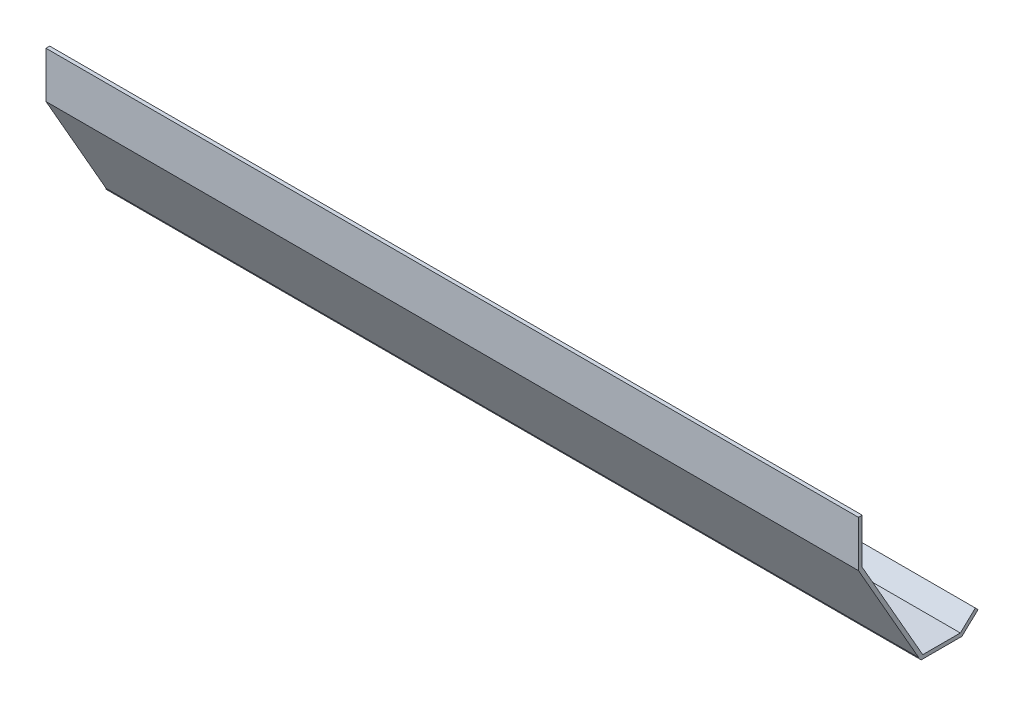
ISO-10303-21;
HEADER;
FILE_DESCRIPTION(('STEP AP214'),'2;1');
FILE_NAME('part.step','',(''),(''),'','','');
FILE_SCHEMA(('AUTOMOTIVE_DESIGN { 1 0 10303 214 1 1 1 1 }'));
ENDSEC;
DATA;
#1=APPLICATION_CONTEXT('core data for automotive mechanical design processes');
#2=APPLICATION_PROTOCOL_DEFINITION('international standard','automotive_design',2000,#1);
#3=PRODUCT_CONTEXT('',#1,'mechanical');
#4=PRODUCT('Part','Part','',(#3));
#5=PRODUCT_RELATED_PRODUCT_CATEGORY('part','',(#4));
#6=PRODUCT_DEFINITION_FORMATION('','',#4);
#7=PRODUCT_DEFINITION_CONTEXT('part definition',#1,'design');
#8=PRODUCT_DEFINITION('design','',#6,#7);
#9=PRODUCT_DEFINITION_SHAPE('','',#8);
#10=(LENGTH_UNIT() NAMED_UNIT(*) SI_UNIT(.MILLI.,.METRE.));
#11=(NAMED_UNIT(*) PLANE_ANGLE_UNIT() SI_UNIT($,.RADIAN.));
#12=(NAMED_UNIT(*) SI_UNIT($,.STERADIAN.) SOLID_ANGLE_UNIT());
#13=UNCERTAINTY_MEASURE_WITH_UNIT(LENGTH_MEASURE(1.E-05),#10,'distance_accuracy_value','');
#14=(GEOMETRIC_REPRESENTATION_CONTEXT(3) GLOBAL_UNCERTAINTY_ASSIGNED_CONTEXT((#13)) GLOBAL_UNIT_ASSIGNED_CONTEXT((#10,
#11,#12)) REPRESENTATION_CONTEXT('',''));
#15=CARTESIAN_POINT('',(0.,0.,0.));
#16=DIRECTION('',(0.,0.,1.));
#17=DIRECTION('',(1.,0.,0.));
#18=AXIS2_PLACEMENT_3D('',#15,#16,#17);
#19=CARTESIAN_POINT('',(685.8,0.,0.));
#20=DIRECTION('',(0.,-0.496138938356834,0.868243142124459));
#21=DIRECTION('',(0.,-0.868243142124459,-0.496138938356834));
#22=AXIS2_PLACEMENT_3D('',#19,#20,#21);
#23=PLANE('',#22);
#24=DIRECTION('',(0.,0.868243142124459,0.496138938356834));
#25=VECTOR('',#24,1.);
#26=CARTESIAN_POINT('',(0.,0.,0.));
#27=LINE('',#26,#25);
#28=CARTESIAN_POINT('',(0.,0.,0.));
#29=VERTEX_POINT('',#28);
#30=CARTESIAN_POINT('',(0.,88.9,50.8));
#31=VERTEX_POINT('',#30);
#32=EDGE_CURVE('E165',#29,#31,#27,.T.);
#33=ORIENTED_EDGE('',*,*,#32,.T.);
#34=DIRECTION('',(-1.,0.,0.));
#35=VECTOR('',#34,1.);
#36=CARTESIAN_POINT('',(685.8,88.9,50.8));
#37=LINE('',#36,#35);
#38=CARTESIAN_POINT('',(685.8,88.9,50.8));
#39=VERTEX_POINT('',#38);
#40=EDGE_CURVE('E11',#39,#31,#37,.T.);
#41=ORIENTED_EDGE('',*,*,#40,.F.);
#42=DIRECTION('',(0.,0.868243142124459,0.496138938356834));
#43=VECTOR('',#42,1.);
#44=CARTESIAN_POINT('',(685.8,0.,0.));
#45=LINE('',#44,#43);
#46=CARTESIAN_POINT('',(685.8,0.,0.));
#47=VERTEX_POINT('',#46);
#48=EDGE_CURVE('E191',#47,#39,#45,.T.);
#49=ORIENTED_EDGE('',*,*,#48,.F.);
#50=DIRECTION('',(-1.,0.,0.));
#51=VECTOR('',#50,1.);
#52=CARTESIAN_POINT('',(685.8,0.,0.));
#53=LINE('',#52,#51);
#54=EDGE_CURVE('E161',#47,#29,#53,.T.);
#55=ORIENTED_EDGE('',*,*,#54,.T.);
#56=EDGE_LOOP('',(#33,#41,#49,#55));
#57=FACE_BOUND('',#56,.T.);
#58=ADVANCED_FACE('F33',(#57),#23,.F.);
#59=CARTESIAN_POINT('',(685.8,88.9,50.8));
#60=DIRECTION('',(0.,0.,1.));
#61=DIRECTION('',(1.,0.,0.));
#62=AXIS2_PLACEMENT_3D('',#59,#60,#61);
#63=PLANE('',#62);
#64=DIRECTION('',(0.,1.,0.));
#65=VECTOR('',#64,1.);
#66=CARTESIAN_POINT('',(0.,88.9,50.8));
#67=LINE('',#66,#65);
#68=CARTESIAN_POINT('',(0.,127.,50.8));
#69=VERTEX_POINT('',#68);
#70=EDGE_CURVE('E168',#31,#69,#67,.T.);
#71=ORIENTED_EDGE('',*,*,#70,.T.);
#72=DIRECTION('',(-1.,0.,0.));
#73=VECTOR('',#72,1.);
#74=CARTESIAN_POINT('',(685.8,127.,50.8));
#75=LINE('',#74,#73);
#76=CARTESIAN_POINT('',(685.8,127.,50.8));
#77=VERTEX_POINT('',#76);
#78=EDGE_CURVE('E41',#77,#69,#75,.T.);
#79=ORIENTED_EDGE('',*,*,#78,.F.);
#80=DIRECTION('',(0.,1.,0.));
#81=VECTOR('',#80,1.);
#82=CARTESIAN_POINT('',(685.8,88.9,50.8));
#83=LINE('',#82,#81);
#84=EDGE_CURVE('E110',#39,#77,#83,.T.);
#85=ORIENTED_EDGE('',*,*,#84,.F.);
#86=ORIENTED_EDGE('',*,*,#40,.T.);
#87=EDGE_LOOP('',(#71,#79,#85,#86));
#88=FACE_BOUND('',#87,.T.);
#89=ADVANCED_FACE('F279',(#88),#63,.F.);
#90=CARTESIAN_POINT('',(685.8,127.,50.8));
#91=DIRECTION('',(0.,-1.,0.));
#92=DIRECTION('',(0.,0.,-1.));
#93=AXIS2_PLACEMENT_3D('',#90,#91,#92);
#94=PLANE('',#93);
#95=DIRECTION('',(0.,0.,1.));
#96=VECTOR('',#95,1.);
#97=CARTESIAN_POINT('',(0.,127.,50.8));
#98=LINE('',#97,#96);
#99=CARTESIAN_POINT('',(0.,127.,53.975));
#100=VERTEX_POINT('',#99);
#101=EDGE_CURVE('E170',#69,#100,#98,.T.);
#102=ORIENTED_EDGE('',*,*,#101,.T.);
#103=DIRECTION('',(-1.,0.,0.));
#104=VECTOR('',#103,1.);
#105=CARTESIAN_POINT('',(685.8,127.,53.975));
#106=LINE('',#105,#104);
#107=CARTESIAN_POINT('',(685.8,127.,53.975));
#108=VERTEX_POINT('',#107);
#109=EDGE_CURVE('E216',#108,#100,#106,.T.);
#110=ORIENTED_EDGE('',*,*,#109,.F.);
#111=DIRECTION('',(0.,0.,1.));
#112=VECTOR('',#111,1.);
#113=CARTESIAN_POINT('',(685.8,127.,50.8));
#114=LINE('',#113,#112);
#115=EDGE_CURVE('E224',#77,#108,#114,.T.);
#116=ORIENTED_EDGE('',*,*,#115,.F.);
#117=ORIENTED_EDGE('',*,*,#78,.T.);
#118=EDGE_LOOP('',(#102,#110,#116,#117));
#119=FACE_BOUND('',#118,.T.);
#120=ADVANCED_FACE('F222',(#119),#94,.F.);
#121=CARTESIAN_POINT('',(685.8,127.,53.975));
#122=DIRECTION('',(0.,0.,-1.));
#123=DIRECTION('',(0.,1.,0.));
#124=AXIS2_PLACEMENT_3D('',#121,#122,#123);
#125=PLANE('',#124);
#126=DIRECTION('',(0.,-1.,0.));
#127=VECTOR('',#126,1.);
#128=CARTESIAN_POINT('',(0.,127.,53.975));
#129=LINE('',#128,#127);
#130=CARTESIAN_POINT('',(0.,88.0568329122881,53.975));
#131=VERTEX_POINT('',#130);
#132=EDGE_CURVE('E172',#100,#131,#129,.T.);
#133=ORIENTED_EDGE('',*,*,#132,.T.);
#134=DIRECTION('',(-1.,0.,0.));
#135=VECTOR('',#134,1.);
#136=CARTESIAN_POINT('',(685.8,88.0568329122881,53.975));
#137=LINE('',#136,#135);
#138=CARTESIAN_POINT('',(685.8,88.0568329122881,53.975));
#139=VERTEX_POINT('',#138);
#140=EDGE_CURVE('E213',#139,#131,#137,.T.);
#141=ORIENTED_EDGE('',*,*,#140,.F.);
#142=DIRECTION('',(0.,-1.,0.));
#143=VECTOR('',#142,1.);
#144=CARTESIAN_POINT('',(685.8,127.,53.975));
#145=LINE('',#144,#143);
#146=EDGE_CURVE('E242',#108,#139,#145,.T.);
#147=ORIENTED_EDGE('',*,*,#146,.F.);
#148=ORIENTED_EDGE('',*,*,#109,.T.);
#149=EDGE_LOOP('',(#133,#141,#147,#148));
#150=FACE_BOUND('',#149,.T.);
#151=ADVANCED_FACE('F233',(#150),#125,.F.);
#152=CARTESIAN_POINT('',(685.8,88.0568329122881,53.975));
#153=DIRECTION('',(0.,0.496138938356834,-0.868243142124459));
#154=DIRECTION('',(0.,0.868243142124459,0.496138938356834));
#155=AXIS2_PLACEMENT_3D('',#152,#153,#154);
#156=PLANE('',#155);
#157=DIRECTION('',(0.,-0.868243142124459,-0.496138938356834));
#158=VECTOR('',#157,1.);
#159=CARTESIAN_POINT('',(0.,88.0568329122881,53.975));
#160=LINE('',#159,#158);
#161=CARTESIAN_POINT('',(0.,-0.843167087711942,3.17499999999999));
#162=VERTEX_POINT('',#161);
#163=EDGE_CURVE('E174',#131,#162,#160,.T.);
#164=ORIENTED_EDGE('',*,*,#163,.T.);
#165=DIRECTION('',(-1.,0.,0.));
#166=VECTOR('',#165,1.);
#167=CARTESIAN_POINT('',(685.8,-0.843167087711942,3.17499999999999));
#168=LINE('',#167,#166);
#169=CARTESIAN_POINT('',(685.8,-0.843167087711942,3.17499999999999));
#170=VERTEX_POINT('',#169);
#171=EDGE_CURVE('E210',#170,#162,#168,.T.);
#172=ORIENTED_EDGE('',*,*,#171,.F.);
#173=DIRECTION('',(0.,-0.868243142124459,-0.496138938356834));
#174=VECTOR('',#173,1.);
#175=CARTESIAN_POINT('',(685.8,88.0568329122881,53.975));
#176=LINE('',#175,#174);
#177=EDGE_CURVE('E239',#139,#170,#176,.T.);
#178=ORIENTED_EDGE('',*,*,#177,.F.);
#179=ORIENTED_EDGE('',*,*,#140,.T.);
#180=EDGE_LOOP('',(#164,#172,#178,#179));
#181=FACE_BOUND('',#180,.T.);
#182=ADVANCED_FACE('F237',(#181),#156,.F.);
#183=CARTESIAN_POINT('',(685.8,-0.843167087711942,3.17499999999999));
#184=DIRECTION('',(0.,0.,-1.));
#185=DIRECTION('',(0.,1.,0.));
#186=AXIS2_PLACEMENT_3D('',#183,#184,#185);
#187=PLANE('',#186);
#188=DIRECTION('',(0.,-1.,0.));
#189=VECTOR('',#188,1.);
#190=CARTESIAN_POINT('',(0.,-0.843167087711942,3.17499999999999));
#191=LINE('',#190,#189);
#192=CARTESIAN_POINT('',(0.,-1.56912806053456,3.17499999999999));
#193=VERTEX_POINT('',#192);
#194=EDGE_CURVE('E176',#162,#193,#191,.T.);
#195=ORIENTED_EDGE('',*,*,#194,.T.);
#196=DIRECTION('',(-1.,0.,0.));
#197=VECTOR('',#196,1.);
#198=CARTESIAN_POINT('',(685.8,-1.56912806053456,3.17499999999999));
#199=LINE('',#198,#197);
#200=CARTESIAN_POINT('',(685.8,-1.56912806053456,3.17499999999999));
#201=VERTEX_POINT('',#200);
#202=EDGE_CURVE('E207',#201,#193,#199,.T.);
#203=ORIENTED_EDGE('',*,*,#202,.F.);
#204=DIRECTION('',(0.,-1.,0.));
#205=VECTOR('',#204,1.);
#206=CARTESIAN_POINT('',(685.8,-0.843167087711942,3.17499999999999));
#207=LINE('',#206,#205);
#208=EDGE_CURVE('E241',#170,#201,#207,.T.);
#209=ORIENTED_EDGE('',*,*,#208,.F.);
#210=ORIENTED_EDGE('',*,*,#171,.T.);
#211=EDGE_LOOP('',(#195,#203,#209,#210));
#212=FACE_BOUND('',#211,.T.);
#213=ADVANCED_FACE('F292',(#212),#187,.F.);
#214=CARTESIAN_POINT('',(685.8,-1.56912806053456,3.17499999999999));
#215=DIRECTION('',(0.,0.707106781186537,-0.707106781186558));
#216=DIRECTION('',(0.,0.707106781186558,0.707106781186537));
#217=AXIS2_PLACEMENT_3D('',#214,#215,#216);
#218=PLANE('',#217);
#219=DIRECTION('',(0.,-0.707106781186558,-0.707106781186537));
#220=VECTOR('',#219,1.);
#221=CARTESIAN_POINT('',(0.,-1.56912806053456,3.17499999999999));
#222=LINE('',#221,#220);
#223=CARTESIAN_POINT('',(0.,-3.68299999999997,1.06112806053465));
#224=VERTEX_POINT('',#223);
#225=EDGE_CURVE('E178',#193,#224,#222,.T.);
#226=ORIENTED_EDGE('',*,*,#225,.T.);
#227=DIRECTION('',(-1.,0.,0.));
#228=VECTOR('',#227,1.);
#229=CARTESIAN_POINT('',(685.8,-3.68299999999997,1.06112806053465));
#230=LINE('',#229,#228);
#231=CARTESIAN_POINT('',(685.8,-3.68299999999997,1.06112806053465));
#232=VERTEX_POINT('',#231);
#233=EDGE_CURVE('E204',#232,#224,#230,.T.);
#234=ORIENTED_EDGE('',*,*,#233,.F.);
#235=DIRECTION('',(0.,-0.707106781186558,-0.707106781186537));
#236=VECTOR('',#235,1.);
#237=CARTESIAN_POINT('',(685.8,-1.56912806053456,3.17499999999999));
#238=LINE('',#237,#236);
#239=EDGE_CURVE('E244',#201,#232,#238,.T.);
#240=ORIENTED_EDGE('',*,*,#239,.F.);
#241=ORIENTED_EDGE('',*,*,#202,.T.);
#242=EDGE_LOOP('',(#226,#234,#240,#241));
#243=FACE_BOUND('',#242,.T.);
#244=ADVANCED_FACE('F295',(#243),#218,.F.);
#245=CARTESIAN_POINT('',(685.8,-3.68299999999997,1.06112806053465));
#246=DIRECTION('',(0.,1.,0.));
#247=DIRECTION('',(0.,0.,1.));
#248=AXIS2_PLACEMENT_3D('',#245,#246,#247);
#249=PLANE('',#248);
#250=DIRECTION('',(0.,0.,-1.));
#251=VECTOR('',#250,1.);
#252=CARTESIAN_POINT('',(0.,-3.68299999999997,1.06112806053465));
#253=LINE('',#252,#251);
#254=CARTESIAN_POINT('',(0.,-3.68299999999997,-33.3577240911878));
#255=VERTEX_POINT('',#254);
#256=EDGE_CURVE('E180',#224,#255,#253,.T.);
#257=ORIENTED_EDGE('',*,*,#256,.T.);
#258=DIRECTION('',(-1.,0.,0.));
#259=VECTOR('',#258,1.);
#260=CARTESIAN_POINT('',(685.8,-3.68299999999997,-33.3577240911878));
#261=LINE('',#260,#259);
#262=CARTESIAN_POINT('',(685.8,-3.68299999999997,-33.3577240911878));
#263=VERTEX_POINT('',#262);
#264=EDGE_CURVE('E201',#263,#255,#261,.T.);
#265=ORIENTED_EDGE('',*,*,#264,.F.);
#266=DIRECTION('',(0.,0.,-1.));
#267=VECTOR('',#266,1.);
#268=CARTESIAN_POINT('',(685.8,-3.68299999999997,1.06112806053465));
#269=LINE('',#268,#267);
#270=EDGE_CURVE('E250',#232,#263,#269,.T.);
#271=ORIENTED_EDGE('',*,*,#270,.F.);
#272=ORIENTED_EDGE('',*,*,#233,.T.);
#273=EDGE_LOOP('',(#257,#265,#271,#272));
#274=FACE_BOUND('',#273,.T.);
#275=ADVANCED_FACE('F299',(#274),#249,.F.);
#276=CARTESIAN_POINT('',(685.8,-3.68299999999997,-33.3577240911878));
#277=DIRECTION('',(0.,0.72994299108957,0.683508031963936));
#278=DIRECTION('',(0.,-0.683508031963936,0.72994299108957));
#279=AXIS2_PLACEMENT_3D('',#276,#277,#278);
#280=PLANE('',#279);
#281=DIRECTION('',(0.,0.683508031963936,-0.72994299108957));
#282=VECTOR('',#281,1.);
#283=CARTESIAN_POINT('',(0.,-3.68299999999997,-33.3577240911878));
#284=LINE('',#283,#282);
#285=CARTESIAN_POINT('',(0.,9.01700000000001,-46.9205142170055));
#286=VERTEX_POINT('',#285);
#287=EDGE_CURVE('E182',#255,#286,#284,.T.);
#288=ORIENTED_EDGE('',*,*,#287,.T.);
#289=DIRECTION('',(-1.,0.,0.));
#290=VECTOR('',#289,1.);
#291=CARTESIAN_POINT('',(685.8,9.01700000000001,-46.9205142170055));
#292=LINE('',#291,#290);
#293=CARTESIAN_POINT('',(685.8,9.01700000000001,-46.9205142170055));
#294=VERTEX_POINT('',#293);
#295=EDGE_CURVE('E198',#294,#286,#292,.T.);
#296=ORIENTED_EDGE('',*,*,#295,.F.);
#297=DIRECTION('',(0.,0.683508031963936,-0.72994299108957));
#298=VECTOR('',#297,1.);
#299=CARTESIAN_POINT('',(685.8,-3.68299999999997,-33.3577240911878));
#300=LINE('',#299,#298);
#301=EDGE_CURVE('E252',#263,#294,#300,.T.);
#302=ORIENTED_EDGE('',*,*,#301,.F.);
#303=ORIENTED_EDGE('',*,*,#264,.T.);
#304=EDGE_LOOP('',(#288,#296,#302,#303));
#305=FACE_BOUND('',#304,.T.);
#306=ADVANCED_FACE('F303',(#305),#280,.F.);
#307=CARTESIAN_POINT('',(685.8,9.01700000000001,-46.9205142170055));
#308=DIRECTION('',(0.,-0.683508031963937,0.729942991089568));
#309=DIRECTION('',(0.,-0.729942991089568,-0.683508031963937));
#310=AXIS2_PLACEMENT_3D('',#307,#308,#309);
#311=PLANE('',#310);
#312=DIRECTION('',(0.,0.729942991089568,0.683508031963937));
#313=VECTOR('',#312,1.);
#314=CARTESIAN_POINT('',(0.,9.01700000000001,-46.9205142170055));
#315=LINE('',#314,#313);
#316=CARTESIAN_POINT('',(0.,11.384095837491,-44.704));
#317=VERTEX_POINT('',#316);
#318=EDGE_CURVE('E184',#286,#317,#315,.T.);
#319=ORIENTED_EDGE('',*,*,#318,.T.);
#320=DIRECTION('',(-1.,0.,0.));
#321=VECTOR('',#320,1.);
#322=CARTESIAN_POINT('',(685.8,11.384095837491,-44.704));
#323=LINE('',#322,#321);
#324=CARTESIAN_POINT('',(685.8,11.384095837491,-44.704));
#325=VERTEX_POINT('',#324);
#326=EDGE_CURVE('E195',#325,#317,#323,.T.);
#327=ORIENTED_EDGE('',*,*,#326,.F.);
#328=DIRECTION('',(0.,0.729942991089568,0.683508031963937));
#329=VECTOR('',#328,1.);
#330=CARTESIAN_POINT('',(685.8,9.01700000000001,-46.9205142170055));
#331=LINE('',#330,#329);
#332=EDGE_CURVE('E254',#294,#325,#331,.T.);
#333=ORIENTED_EDGE('',*,*,#332,.F.);
#334=ORIENTED_EDGE('',*,*,#295,.T.);
#335=EDGE_LOOP('',(#319,#327,#333,#334));
#336=FACE_BOUND('',#335,.T.);
#337=ADVANCED_FACE('F260',(#336),#311,.F.);
#338=CARTESIAN_POINT('',(685.8,11.384095837491,-44.704));
#339=DIRECTION('',(0.,-0.729942991089569,-0.683508031963937));
#340=DIRECTION('',(0.,0.683508031963937,-0.729942991089569));
#341=AXIS2_PLACEMENT_3D('',#338,#339,#340);
#342=PLANE('',#341);
#343=DIRECTION('',(0.,-0.683508031963937,0.729942991089569));
#344=VECTOR('',#343,1.);
#345=CARTESIAN_POINT('',(0.,11.384095837491,-44.704));
#346=LINE('',#345,#344);
#347=CARTESIAN_POINT('',(0.,-0.508000000000008,-32.004));
#348=VERTEX_POINT('',#347);
#349=EDGE_CURVE('E186',#317,#348,#346,.T.);
#350=ORIENTED_EDGE('',*,*,#349,.T.);
#351=DIRECTION('',(-1.,0.,0.));
#352=VECTOR('',#351,1.);
#353=CARTESIAN_POINT('',(685.8,-0.508000000000008,-32.004));
#354=LINE('',#353,#352);
#355=CARTESIAN_POINT('',(685.8,-0.508000000000008,-32.004));
#356=VERTEX_POINT('',#355);
#357=EDGE_CURVE('E156',#356,#348,#354,.T.);
#358=ORIENTED_EDGE('',*,*,#357,.F.);
#359=DIRECTION('',(0.,-0.683508031963937,0.729942991089569));
#360=VECTOR('',#359,1.);
#361=CARTESIAN_POINT('',(685.8,11.384095837491,-44.704));
#362=LINE('',#361,#360);
#363=EDGE_CURVE('E147',#325,#356,#362,.T.);
#364=ORIENTED_EDGE('',*,*,#363,.F.);
#365=ORIENTED_EDGE('',*,*,#326,.T.);
#366=EDGE_LOOP('',(#350,#358,#364,#365));
#367=FACE_BOUND('',#366,.T.);
#368=ADVANCED_FACE('F264',(#367),#342,.F.);
#369=CARTESIAN_POINT('',(685.8,-0.508000000000008,-32.004));
#370=DIRECTION('',(0.,-1.,0.));
#371=DIRECTION('',(0.,0.,-1.));
#372=AXIS2_PLACEMENT_3D('',#369,#370,#371);
#373=PLANE('',#372);
#374=DIRECTION('',(0.,0.,1.));
#375=VECTOR('',#374,1.);
#376=CARTESIAN_POINT('',(0.,-0.508000000000008,-32.004));
#377=LINE('',#376,#375);
#378=CARTESIAN_POINT('',(0.,-0.508000000000008,-0.253999999999997));
#379=VERTEX_POINT('',#378);
#380=EDGE_CURVE('E155',#348,#379,#377,.T.);
#381=ORIENTED_EDGE('',*,*,#380,.T.);
#382=DIRECTION('',(-1.,0.,0.));
#383=VECTOR('',#382,1.);
#384=CARTESIAN_POINT('',(685.8,-0.508000000000008,-0.253999999999997));
#385=LINE('',#384,#383);
#386=CARTESIAN_POINT('',(685.8,-0.508000000000008,-0.253999999999997));
#387=VERTEX_POINT('',#386);
#388=EDGE_CURVE('E152',#387,#379,#385,.T.);
#389=ORIENTED_EDGE('',*,*,#388,.F.);
#390=DIRECTION('',(0.,0.,1.));
#391=VECTOR('',#390,1.);
#392=CARTESIAN_POINT('',(685.8,-0.508000000000008,-32.004));
#393=LINE('',#392,#391);
#394=EDGE_CURVE('E141',#356,#387,#393,.T.);
#395=ORIENTED_EDGE('',*,*,#394,.F.);
#396=ORIENTED_EDGE('',*,*,#357,.T.);
#397=EDGE_LOOP('',(#381,#389,#395,#396));
#398=FACE_BOUND('',#397,.T.);
#399=ADVANCED_FACE('F153',(#398),#373,.F.);
#400=CARTESIAN_POINT('',(685.8,-0.508000000000008,-0.253999999999997));
#401=DIRECTION('',(0.,-0.707106781186533,0.707106781186562));
#402=DIRECTION('',(0.,-0.707106781186562,-0.707106781186533));
#403=AXIS2_PLACEMENT_3D('',#400,#401,#402);
#404=PLANE('',#403);
#405=DIRECTION('',(0.,0.707106781186562,0.707106781186533));
#406=VECTOR('',#405,1.);
#407=CARTESIAN_POINT('',(0.,-0.508000000000008,-0.253999999999997));
#408=LINE('',#407,#406);
#409=CARTESIAN_POINT('',(0.,-0.254000000000001,0.));
#410=VERTEX_POINT('',#409);
#411=EDGE_CURVE('E96',#379,#410,#408,.T.);
#412=ORIENTED_EDGE('',*,*,#411,.T.);
#413=DIRECTION('',(-1.,0.,0.));
#414=VECTOR('',#413,1.);
#415=CARTESIAN_POINT('',(685.8,-0.254000000000001,0.));
#416=LINE('',#415,#414);
#417=CARTESIAN_POINT('',(685.8,-0.254000000000001,0.));
#418=VERTEX_POINT('',#417);
#419=EDGE_CURVE('E157',#418,#410,#416,.T.);
#420=ORIENTED_EDGE('',*,*,#419,.F.);
#421=DIRECTION('',(0.,0.707106781186562,0.707106781186533));
#422=VECTOR('',#421,1.);
#423=CARTESIAN_POINT('',(685.8,-0.508000000000008,-0.253999999999997));
#424=LINE('',#423,#422);
#425=EDGE_CURVE('E145',#387,#418,#424,.T.);
#426=ORIENTED_EDGE('',*,*,#425,.F.);
#427=ORIENTED_EDGE('',*,*,#388,.T.);
#428=EDGE_LOOP('',(#412,#420,#426,#427));
#429=FACE_BOUND('',#428,.T.);
#430=ADVANCED_FACE('F159',(#429),#404,.F.);
#431=CARTESIAN_POINT('',(685.8,-0.254000000000001,0.));
#432=DIRECTION('',(0.,0.,1.));
#433=DIRECTION('',(1.,0.,0.));
#434=AXIS2_PLACEMENT_3D('',#431,#432,#433);
#435=PLANE('',#434);
#436=DIRECTION('',(0.,1.,0.));
#437=VECTOR('',#436,1.);
#438=CARTESIAN_POINT('',(0.,-0.254000000000001,0.));
#439=LINE('',#438,#437);
#440=EDGE_CURVE('E102',#410,#29,#439,.T.);
#441=ORIENTED_EDGE('',*,*,#440,.T.);
#442=ORIENTED_EDGE('',*,*,#54,.F.);
#443=DIRECTION('',(0.,1.,0.));
#444=VECTOR('',#443,1.);
#445=CARTESIAN_POINT('',(685.8,-0.254000000000001,0.));
#446=LINE('',#445,#444);
#447=EDGE_CURVE('E49',#418,#47,#446,.T.);
#448=ORIENTED_EDGE('',*,*,#447,.F.);
#449=ORIENTED_EDGE('',*,*,#419,.T.);
#450=EDGE_LOOP('',(#441,#442,#448,#449));
#451=FACE_BOUND('',#450,.T.);
#452=ADVANCED_FACE('F268',(#451),#435,.F.);
#453=CARTESIAN_POINT('',(685.8,0.,0.));
#454=DIRECTION('',(-1.,0.,0.));
#455=DIRECTION('',(0.,0.,1.));
#456=AXIS2_PLACEMENT_3D('',#453,#454,#455);
#457=PLANE('',#456);
#458=ORIENTED_EDGE('',*,*,#48,.T.);
#459=ORIENTED_EDGE('',*,*,#84,.T.);
#460=ORIENTED_EDGE('',*,*,#115,.T.);
#461=ORIENTED_EDGE('',*,*,#146,.T.);
#462=ORIENTED_EDGE('',*,*,#177,.T.);
#463=ORIENTED_EDGE('',*,*,#208,.T.);
#464=ORIENTED_EDGE('',*,*,#239,.T.);
#465=ORIENTED_EDGE('',*,*,#270,.T.);
#466=ORIENTED_EDGE('',*,*,#301,.T.);
#467=ORIENTED_EDGE('',*,*,#332,.T.);
#468=ORIENTED_EDGE('',*,*,#363,.T.);
#469=ORIENTED_EDGE('',*,*,#394,.T.);
#470=ORIENTED_EDGE('',*,*,#425,.T.);
#471=ORIENTED_EDGE('',*,*,#447,.T.);
#472=EDGE_LOOP('',(#458,#459,#460,#461,#462,#463,#464,#465,#466,#467,#468,#469,#470,#471));
#473=FACE_BOUND('',#472,.T.);
#474=ADVANCED_FACE('F143',(#473),#457,.F.);
#475=CARTESIAN_POINT('',(0.,0.,0.));
#476=DIRECTION('',(-1.,0.,0.));
#477=DIRECTION('',(0.,0.,1.));
#478=AXIS2_PLACEMENT_3D('',#475,#476,#477);
#479=PLANE('',#478);
#480=ORIENTED_EDGE('',*,*,#32,.F.);
#481=ORIENTED_EDGE('',*,*,#440,.F.);
#482=ORIENTED_EDGE('',*,*,#411,.F.);
#483=ORIENTED_EDGE('',*,*,#380,.F.);
#484=ORIENTED_EDGE('',*,*,#349,.F.);
#485=ORIENTED_EDGE('',*,*,#318,.F.);
#486=ORIENTED_EDGE('',*,*,#287,.F.);
#487=ORIENTED_EDGE('',*,*,#256,.F.);
#488=ORIENTED_EDGE('',*,*,#225,.F.);
#489=ORIENTED_EDGE('',*,*,#194,.F.);
#490=ORIENTED_EDGE('',*,*,#163,.F.);
#491=ORIENTED_EDGE('',*,*,#132,.F.);
#492=ORIENTED_EDGE('',*,*,#101,.F.);
#493=ORIENTED_EDGE('',*,*,#70,.F.);
#494=EDGE_LOOP('',(#480,#481,#482,#483,#484,#485,#486,#487,#488,#489,#490,#491,#492,#493));
#495=FACE_BOUND('',#494,.T.);
#496=ADVANCED_FACE('F228',(#495),#479,.T.);
#497=CLOSED_SHELL('',(#58,#89,#120,#151,#182,#213,#244,#275,#306,#337,#368,#399,#430,#452,#474,#496));
#498=MANIFOLD_SOLID_BREP('B2',#497);
#499=ADVANCED_BREP_SHAPE_REPRESENTATION('',(#18,#498),#14);
#500=SHAPE_DEFINITION_REPRESENTATION(#9,#499);
ENDSEC;
END-ISO-10303-21;
